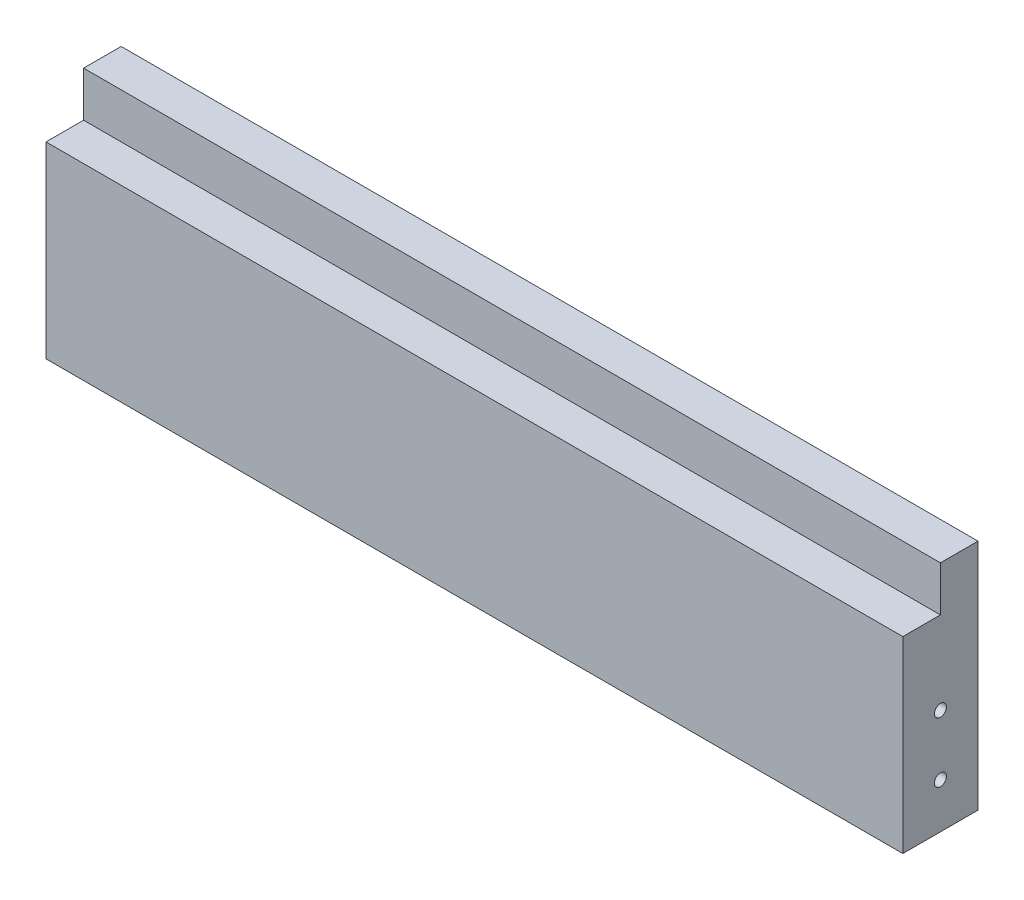
ISO-10303-21;
HEADER;
FILE_DESCRIPTION(('STEP AP214'),'2;1');
FILE_NAME('part.step','',(''),(''),'','','');
FILE_SCHEMA(('AUTOMOTIVE_DESIGN { 1 0 10303 214 1 1 1 1 }'));
ENDSEC;
DATA;
#1=APPLICATION_CONTEXT('core data for automotive mechanical design processes');
#2=APPLICATION_PROTOCOL_DEFINITION('international standard','automotive_design',2000,#1);
#3=PRODUCT_CONTEXT('',#1,'mechanical');
#4=PRODUCT('Part','Part','',(#3));
#5=PRODUCT_RELATED_PRODUCT_CATEGORY('part','',(#4));
#6=PRODUCT_DEFINITION_FORMATION('','',#4);
#7=PRODUCT_DEFINITION_CONTEXT('part definition',#1,'design');
#8=PRODUCT_DEFINITION('design','',#6,#7);
#9=PRODUCT_DEFINITION_SHAPE('','',#8);
#10=(LENGTH_UNIT() NAMED_UNIT(*) SI_UNIT(.MILLI.,.METRE.));
#11=(NAMED_UNIT(*) PLANE_ANGLE_UNIT() SI_UNIT($,.RADIAN.));
#12=(NAMED_UNIT(*) SI_UNIT($,.STERADIAN.) SOLID_ANGLE_UNIT());
#13=UNCERTAINTY_MEASURE_WITH_UNIT(LENGTH_MEASURE(1.E-05),#10,'distance_accuracy_value','');
#14=(GEOMETRIC_REPRESENTATION_CONTEXT(3) GLOBAL_UNCERTAINTY_ASSIGNED_CONTEXT((#13)) GLOBAL_UNIT_ASSIGNED_CONTEXT((#10,
#11,#12)) REPRESENTATION_CONTEXT('',''));
#15=CARTESIAN_POINT('',(0.,0.,0.));
#16=DIRECTION('',(0.,0.,1.));
#17=DIRECTION('',(1.,0.,0.));
#18=AXIS2_PLACEMENT_3D('',#15,#16,#17);
#19=CARTESIAN_POINT('',(0.,0.,10.));
#20=DIRECTION('',(1.,0.,0.));
#21=DIRECTION('',(0.,0.,-1.));
#22=AXIS2_PLACEMENT_3D('',#19,#20,#21);
#23=PLANE('',#22);
#24=CARTESIAN_POINT('',(0.,14.,5.));
#25=DIRECTION('',(-1.,0.,0.));
#26=DIRECTION('',(0.,0.,1.));
#27=AXIS2_PLACEMENT_3D('',#24,#25,#26);
#28=CIRCLE('',#27,0.79999999999999);
#29=CARTESIAN_POINT('',(0.,14.,5.79999999999999));
#30=VERTEX_POINT('',#29);
#31=EDGE_CURVE('E149',#30,#30,#28,.T.);
#32=ORIENTED_EDGE('',*,*,#31,.F.);
#33=EDGE_LOOP('',(#32));
#34=FACE_BOUND('',#33,.T.);
#35=CARTESIAN_POINT('',(0.,6.,5.));
#36=DIRECTION('',(-1.,0.,0.));
#37=DIRECTION('',(0.,0.,1.));
#38=AXIS2_PLACEMENT_3D('',#35,#36,#37);
#39=CIRCLE('',#38,0.79999999999999);
#40=CARTESIAN_POINT('',(0.,6.,5.79999999999999));
#41=VERTEX_POINT('',#40);
#42=EDGE_CURVE('E143',#41,#41,#39,.T.);
#43=ORIENTED_EDGE('',*,*,#42,.F.);
#44=EDGE_LOOP('',(#43));
#45=FACE_BOUND('',#44,.T.);
#46=DIRECTION('',(0.,-1.,0.));
#47=VECTOR('',#46,1.);
#48=CARTESIAN_POINT('',(0.,0.,10.));
#49=LINE('',#48,#47);
#50=CARTESIAN_POINT('',(0.,25.,10.));
#51=VERTEX_POINT('',#50);
#52=CARTESIAN_POINT('',(0.,0.,10.));
#53=VERTEX_POINT('',#52);
#54=EDGE_CURVE('E103',#51,#53,#49,.T.);
#55=ORIENTED_EDGE('',*,*,#54,.F.);
#56=DIRECTION('',(0.,0.,1.));
#57=VECTOR('',#56,1.);
#58=CARTESIAN_POINT('',(0.,25.,5.));
#59=LINE('',#58,#57);
#60=CARTESIAN_POINT('',(0.,25.,5.));
#61=VERTEX_POINT('',#60);
#62=EDGE_CURVE('E53',#61,#51,#59,.T.);
#63=ORIENTED_EDGE('',*,*,#62,.F.);
#64=DIRECTION('',(0.,-1.,0.));
#65=VECTOR('',#64,1.);
#66=CARTESIAN_POINT('',(0.,31.,5.));
#67=LINE('',#66,#65);
#68=CARTESIAN_POINT('',(0.,31.,5.));
#69=VERTEX_POINT('',#68);
#70=EDGE_CURVE('E90',#69,#61,#67,.T.);
#71=ORIENTED_EDGE('',*,*,#70,.F.);
#72=DIRECTION('',(0.,0.,-1.));
#73=VECTOR('',#72,1.);
#74=CARTESIAN_POINT('',(0.,31.,10.));
#75=LINE('',#74,#73);
#76=CARTESIAN_POINT('',(0.,31.,0.));
#77=VERTEX_POINT('',#76);
#78=EDGE_CURVE('E82',#69,#77,#75,.T.);
#79=ORIENTED_EDGE('',*,*,#78,.T.);
#80=DIRECTION('',(0.,-1.,0.));
#81=VECTOR('',#80,1.);
#82=CARTESIAN_POINT('',(0.,0.,0.));
#83=LINE('',#82,#81);
#84=CARTESIAN_POINT('',(0.,0.,0.));
#85=VERTEX_POINT('',#84);
#86=EDGE_CURVE('E87',#77,#85,#83,.T.);
#87=ORIENTED_EDGE('',*,*,#86,.T.);
#88=DIRECTION('',(0.,0.,-1.));
#89=VECTOR('',#88,1.);
#90=CARTESIAN_POINT('',(0.,0.,10.));
#91=LINE('',#90,#89);
#92=EDGE_CURVE('E11',#53,#85,#91,.T.);
#93=ORIENTED_EDGE('',*,*,#92,.F.);
#94=EDGE_LOOP('',(#55,#63,#71,#79,#87,#93));
#95=FACE_BOUND('',#94,.T.);
#96=ADVANCED_FACE('F39',(#34,#45,#95),#23,.F.);
#97=CARTESIAN_POINT('',(0.,0.,10.));
#98=DIRECTION('',(0.,1.,0.));
#99=DIRECTION('',(0.,0.,1.));
#100=AXIS2_PLACEMENT_3D('',#97,#98,#99);
#101=PLANE('',#100);
#102=CARTESIAN_POINT('',(102.,0.,4.99999999999981));
#103=DIRECTION('',(0.,-1.,0.));
#104=DIRECTION('',(0.,0.,-1.));
#105=AXIS2_PLACEMENT_3D('',#102,#103,#104);
#106=CIRCLE('',#105,0.799999999999995);
#107=CARTESIAN_POINT('',(102.,0.,4.19999999999981));
#108=VERTEX_POINT('',#107);
#109=EDGE_CURVE('E191',#108,#108,#106,.T.);
#110=ORIENTED_EDGE('',*,*,#109,.F.);
#111=EDGE_LOOP('',(#110));
#112=FACE_BOUND('',#111,.T.);
#113=CARTESIAN_POINT('',(12.,0.,4.99999999999981));
#114=DIRECTION('',(0.,-1.,0.));
#115=DIRECTION('',(0.,0.,-1.));
#116=AXIS2_PLACEMENT_3D('',#113,#114,#115);
#117=CIRCLE('',#116,0.799999999999999);
#118=CARTESIAN_POINT('',(12.,0.,4.19999999999981));
#119=VERTEX_POINT('',#118);
#120=EDGE_CURVE('E185',#119,#119,#117,.T.);
#121=ORIENTED_EDGE('',*,*,#120,.F.);
#122=EDGE_LOOP('',(#121));
#123=FACE_BOUND('',#122,.T.);
#124=CARTESIAN_POINT('',(57.,0.,4.99999999999981));
#125=DIRECTION('',(0.,-1.,0.));
#126=DIRECTION('',(0.,0.,-1.));
#127=AXIS2_PLACEMENT_3D('',#124,#125,#126);
#128=CIRCLE('',#127,0.800000000000002);
#129=CARTESIAN_POINT('',(57.,0.,4.19999999999981));
#130=VERTEX_POINT('',#129);
#131=EDGE_CURVE('E179',#130,#130,#128,.T.);
#132=ORIENTED_EDGE('',*,*,#131,.F.);
#133=EDGE_LOOP('',(#132));
#134=FACE_BOUND('',#133,.T.);
#135=CARTESIAN_POINT('',(79.,0.,4.99999999999981));
#136=DIRECTION('',(0.,-1.,0.));
#137=DIRECTION('',(0.,0.,-1.));
#138=AXIS2_PLACEMENT_3D('',#135,#136,#137);
#139=CIRCLE('',#138,0.799999999999995);
#140=CARTESIAN_POINT('',(79.,0.,4.19999999999981));
#141=VERTEX_POINT('',#140);
#142=EDGE_CURVE('E173',#141,#141,#139,.T.);
#143=ORIENTED_EDGE('',*,*,#142,.F.);
#144=EDGE_LOOP('',(#143));
#145=FACE_BOUND('',#144,.T.);
#146=CARTESIAN_POINT('',(35.,0.,4.99999999999981));
#147=DIRECTION('',(0.,-1.,0.));
#148=DIRECTION('',(0.,0.,-1.));
#149=AXIS2_PLACEMENT_3D('',#146,#147,#148);
#150=CIRCLE('',#149,0.800000000000002);
#151=CARTESIAN_POINT('',(35.,0.,4.19999999999981));
#152=VERTEX_POINT('',#151);
#153=EDGE_CURVE('E167',#152,#152,#150,.T.);
#154=ORIENTED_EDGE('',*,*,#153,.F.);
#155=EDGE_LOOP('',(#154));
#156=FACE_BOUND('',#155,.T.);
#157=DIRECTION('',(1.,0.,0.));
#158=VECTOR('',#157,1.);
#159=CARTESIAN_POINT('',(0.,0.,0.));
#160=LINE('',#159,#158);
#161=CARTESIAN_POINT('',(114.,0.,0.));
#162=VERTEX_POINT('',#161);
#163=EDGE_CURVE('E107',#85,#162,#160,.T.);
#164=ORIENTED_EDGE('',*,*,#163,.T.);
#165=DIRECTION('',(0.,0.,-1.));
#166=VECTOR('',#165,1.);
#167=CARTESIAN_POINT('',(114.,0.,10.));
#168=LINE('',#167,#166);
#169=CARTESIAN_POINT('',(114.,0.,10.));
#170=VERTEX_POINT('',#169);
#171=EDGE_CURVE('E46',#170,#162,#168,.T.);
#172=ORIENTED_EDGE('',*,*,#171,.F.);
#173=DIRECTION('',(1.,0.,0.));
#174=VECTOR('',#173,1.);
#175=CARTESIAN_POINT('',(0.,0.,10.));
#176=LINE('',#175,#174);
#177=EDGE_CURVE('E62',#53,#170,#176,.T.);
#178=ORIENTED_EDGE('',*,*,#177,.F.);
#179=ORIENTED_EDGE('',*,*,#92,.T.);
#180=EDGE_LOOP('',(#164,#172,#178,#179));
#181=FACE_BOUND('',#180,.T.);
#182=ADVANCED_FACE('F123',(#112,#123,#134,#145,#156,#181),#101,.F.);
#183=CARTESIAN_POINT('',(114.,0.,10.));
#184=DIRECTION('',(-1.,0.,0.));
#185=DIRECTION('',(0.,0.,1.));
#186=AXIS2_PLACEMENT_3D('',#183,#184,#185);
#187=PLANE('',#186);
#188=CARTESIAN_POINT('',(114.,14.,5.));
#189=DIRECTION('',(1.,0.,0.));
#190=DIRECTION('',(0.,0.,-1.));
#191=AXIS2_PLACEMENT_3D('',#188,#189,#190);
#192=CIRCLE('',#191,0.799999999999999);
#193=CARTESIAN_POINT('',(114.,14.,4.2));
#194=VERTEX_POINT('',#193);
#195=EDGE_CURVE('E161',#194,#194,#192,.T.);
#196=ORIENTED_EDGE('',*,*,#195,.F.);
#197=EDGE_LOOP('',(#196));
#198=FACE_BOUND('',#197,.T.);
#199=CARTESIAN_POINT('',(114.,6.,5.));
#200=DIRECTION('',(1.,0.,0.));
#201=DIRECTION('',(0.,0.,-1.));
#202=AXIS2_PLACEMENT_3D('',#199,#200,#201);
#203=CIRCLE('',#202,0.799999999999999);
#204=CARTESIAN_POINT('',(114.,6.,4.2));
#205=VERTEX_POINT('',#204);
#206=EDGE_CURVE('E155',#205,#205,#203,.T.);
#207=ORIENTED_EDGE('',*,*,#206,.F.);
#208=EDGE_LOOP('',(#207));
#209=FACE_BOUND('',#208,.T.);
#210=DIRECTION('',(0.,1.,0.));
#211=VECTOR('',#210,1.);
#212=CARTESIAN_POINT('',(114.,31.,5.));
#213=LINE('',#212,#211);
#214=CARTESIAN_POINT('',(114.,25.,5.));
#215=VERTEX_POINT('',#214);
#216=CARTESIAN_POINT('',(114.,31.,5.));
#217=VERTEX_POINT('',#216);
#218=EDGE_CURVE('E131',#215,#217,#213,.T.);
#219=ORIENTED_EDGE('',*,*,#218,.F.);
#220=DIRECTION('',(0.,0.,1.));
#221=VECTOR('',#220,1.);
#222=CARTESIAN_POINT('',(114.,25.,5.));
#223=LINE('',#222,#221);
#224=CARTESIAN_POINT('',(114.,25.,10.));
#225=VERTEX_POINT('',#224);
#226=EDGE_CURVE('E108',#215,#225,#223,.T.);
#227=ORIENTED_EDGE('',*,*,#226,.T.);
#228=DIRECTION('',(0.,1.,0.));
#229=VECTOR('',#228,1.);
#230=CARTESIAN_POINT('',(114.,0.,10.));
#231=LINE('',#230,#229);
#232=EDGE_CURVE('E94',#170,#225,#231,.T.);
#233=ORIENTED_EDGE('',*,*,#232,.F.);
#234=ORIENTED_EDGE('',*,*,#171,.T.);
#235=DIRECTION('',(0.,1.,0.));
#236=VECTOR('',#235,1.);
#237=CARTESIAN_POINT('',(114.,0.,0.));
#238=LINE('',#237,#236);
#239=CARTESIAN_POINT('',(114.,31.,0.));
#240=VERTEX_POINT('',#239);
#241=EDGE_CURVE('E104',#162,#240,#238,.T.);
#242=ORIENTED_EDGE('',*,*,#241,.T.);
#243=DIRECTION('',(0.,0.,-1.));
#244=VECTOR('',#243,1.);
#245=CARTESIAN_POINT('',(114.,31.,10.));
#246=LINE('',#245,#244);
#247=EDGE_CURVE('E93',#217,#240,#246,.T.);
#248=ORIENTED_EDGE('',*,*,#247,.F.);
#249=EDGE_LOOP('',(#219,#227,#233,#234,#242,#248));
#250=FACE_BOUND('',#249,.T.);
#251=ADVANCED_FACE('F121',(#198,#209,#250),#187,.F.);
#252=CARTESIAN_POINT('',(0.,31.,10.));
#253=DIRECTION('',(0.,-1.,0.));
#254=DIRECTION('',(0.,0.,-1.));
#255=AXIS2_PLACEMENT_3D('',#252,#253,#254);
#256=PLANE('',#255);
#257=ORIENTED_EDGE('',*,*,#78,.F.);
#258=DIRECTION('',(-1.,0.,0.));
#259=VECTOR('',#258,1.);
#260=CARTESIAN_POINT('',(114.,31.,5.));
#261=LINE('',#260,#259);
#262=EDGE_CURVE('E136',#217,#69,#261,.T.);
#263=ORIENTED_EDGE('',*,*,#262,.F.);
#264=ORIENTED_EDGE('',*,*,#247,.T.);
#265=DIRECTION('',(-1.,0.,0.));
#266=VECTOR('',#265,1.);
#267=CARTESIAN_POINT('',(0.,31.,0.));
#268=LINE('',#267,#266);
#269=EDGE_CURVE('E97',#240,#77,#268,.T.);
#270=ORIENTED_EDGE('',*,*,#269,.T.);
#271=EDGE_LOOP('',(#257,#263,#264,#270));
#272=FACE_BOUND('',#271,.T.);
#273=ADVANCED_FACE('F98',(#272),#256,.F.);
#274=CARTESIAN_POINT('',(0.,0.,10.));
#275=DIRECTION('',(0.,0.,-1.));
#276=DIRECTION('',(-1.,0.,0.));
#277=AXIS2_PLACEMENT_3D('',#274,#275,#276);
#278=PLANE('',#277);
#279=ORIENTED_EDGE('',*,*,#232,.T.);
#280=DIRECTION('',(1.,0.,0.));
#281=VECTOR('',#280,1.);
#282=CARTESIAN_POINT('',(114.,25.,10.));
#283=LINE('',#282,#281);
#284=EDGE_CURVE('E129',#51,#225,#283,.T.);
#285=ORIENTED_EDGE('',*,*,#284,.F.);
#286=ORIENTED_EDGE('',*,*,#54,.T.);
#287=ORIENTED_EDGE('',*,*,#177,.T.);
#288=EDGE_LOOP('',(#279,#285,#286,#287));
#289=FACE_BOUND('',#288,.T.);
#290=ADVANCED_FACE('F257',(#289),#278,.F.);
#291=CARTESIAN_POINT('',(0.,0.,0.));
#292=DIRECTION('',(0.,0.,-1.));
#293=DIRECTION('',(-1.,0.,0.));
#294=AXIS2_PLACEMENT_3D('',#291,#292,#293);
#295=PLANE('',#294);
#296=ORIENTED_EDGE('',*,*,#86,.F.);
#297=ORIENTED_EDGE('',*,*,#269,.F.);
#298=ORIENTED_EDGE('',*,*,#241,.F.);
#299=ORIENTED_EDGE('',*,*,#163,.F.);
#300=EDGE_LOOP('',(#296,#297,#298,#299));
#301=FACE_BOUND('',#300,.T.);
#302=ADVANCED_FACE('F106',(#301),#295,.T.);
#303=CARTESIAN_POINT('',(114.,25.,5.));
#304=DIRECTION('',(0.,-1.,0.));
#305=DIRECTION('',(1.,0.,0.));
#306=AXIS2_PLACEMENT_3D('',#303,#304,#305);
#307=PLANE('',#306);
#308=ORIENTED_EDGE('',*,*,#284,.T.);
#309=ORIENTED_EDGE('',*,*,#226,.F.);
#310=DIRECTION('',(1.,0.,0.));
#311=VECTOR('',#310,1.);
#312=CARTESIAN_POINT('',(114.,25.,5.));
#313=LINE('',#312,#311);
#314=EDGE_CURVE('E127',#61,#215,#313,.T.);
#315=ORIENTED_EDGE('',*,*,#314,.F.);
#316=ORIENTED_EDGE('',*,*,#62,.T.);
#317=EDGE_LOOP('',(#308,#309,#315,#316));
#318=FACE_BOUND('',#317,.T.);
#319=ADVANCED_FACE('F253',(#318),#307,.F.);
#320=CARTESIAN_POINT('',(0.,0.,5.));
#321=DIRECTION('',(0.,0.,-1.));
#322=DIRECTION('',(-1.,0.,0.));
#323=AXIS2_PLACEMENT_3D('',#320,#321,#322);
#324=PLANE('',#323);
#325=ORIENTED_EDGE('',*,*,#218,.T.);
#326=ORIENTED_EDGE('',*,*,#262,.T.);
#327=ORIENTED_EDGE('',*,*,#70,.T.);
#328=ORIENTED_EDGE('',*,*,#314,.T.);
#329=EDGE_LOOP('',(#325,#326,#327,#328));
#330=FACE_BOUND('',#329,.T.);
#331=ADVANCED_FACE('F245',(#330),#324,.F.);
#332=CARTESIAN_POINT('',(7.,6.,5.));
#333=DIRECTION('',(-1.,0.,0.));
#334=DIRECTION('',(0.,0.,1.));
#335=AXIS2_PLACEMENT_3D('',#332,#333,#334);
#336=CONICAL_SURFACE('',#335,0.799999999999998,1.02974425867665);
#337=CARTESIAN_POINT('',(7.48068849522205,6.,5.));
#338=VERTEX_POINT('',#337);
#339=VERTEX_LOOP('',#338);
#340=FACE_BOUND('',#339,.T.);
#341=CARTESIAN_POINT('',(7.,6.,5.));
#342=DIRECTION('',(-1.,0.,0.));
#343=DIRECTION('',(0.,0.,1.));
#344=AXIS2_PLACEMENT_3D('',#341,#342,#343);
#345=CIRCLE('',#344,0.799999999999998);
#346=CARTESIAN_POINT('',(7.,6.,5.8));
#347=VERTEX_POINT('',#346);
#348=EDGE_CURVE('E132',#347,#347,#345,.T.);
#349=ORIENTED_EDGE('',*,*,#348,.T.);
#350=EDGE_LOOP('',(#349));
#351=FACE_BOUND('',#350,.T.);
#352=ADVANCED_FACE('F235',(#340,#351),#336,.F.);
#353=CARTESIAN_POINT('',(0.,6.,5.));
#354=DIRECTION('',(-1.,0.,0.));
#355=DIRECTION('',(0.,0.,1.));
#356=AXIS2_PLACEMENT_3D('',#353,#354,#355);
#357=CYLINDRICAL_SURFACE('',#356,0.799999999999994);
#358=ORIENTED_EDGE('',*,*,#348,.F.);
#359=EDGE_LOOP('',(#358));
#360=FACE_BOUND('',#359,.T.);
#361=ORIENTED_EDGE('',*,*,#42,.T.);
#362=EDGE_LOOP('',(#361));
#363=FACE_BOUND('',#362,.T.);
#364=ADVANCED_FACE('F232',(#360,#363),#357,.F.);
#365=CARTESIAN_POINT('',(7.,14.,5.));
#366=DIRECTION('',(-1.,0.,0.));
#367=DIRECTION('',(0.,0.,1.));
#368=AXIS2_PLACEMENT_3D('',#365,#366,#367);
#369=CONICAL_SURFACE('',#368,0.799999999999999,1.02974425867665);
#370=CARTESIAN_POINT('',(7.48068849522205,14.,5.));
#371=VERTEX_POINT('',#370);
#372=VERTEX_LOOP('',#371);
#373=FACE_BOUND('',#372,.T.);
#374=CARTESIAN_POINT('',(7.,14.,5.));
#375=DIRECTION('',(-1.,0.,0.));
#376=DIRECTION('',(0.,0.,1.));
#377=AXIS2_PLACEMENT_3D('',#374,#375,#376);
#378=CIRCLE('',#377,0.799999999999999);
#379=CARTESIAN_POINT('',(7.,14.,5.8));
#380=VERTEX_POINT('',#379);
#381=EDGE_CURVE('E146',#380,#380,#378,.T.);
#382=ORIENTED_EDGE('',*,*,#381,.T.);
#383=EDGE_LOOP('',(#382));
#384=FACE_BOUND('',#383,.T.);
#385=ADVANCED_FACE('F234',(#373,#384),#369,.F.);
#386=CARTESIAN_POINT('',(0.,14.,5.));
#387=DIRECTION('',(-1.,0.,0.));
#388=DIRECTION('',(0.,0.,1.));
#389=AXIS2_PLACEMENT_3D('',#386,#387,#388);
#390=CYLINDRICAL_SURFACE('',#389,0.799999999999994);
#391=ORIENTED_EDGE('',*,*,#381,.F.);
#392=EDGE_LOOP('',(#391));
#393=FACE_BOUND('',#392,.T.);
#394=ORIENTED_EDGE('',*,*,#31,.T.);
#395=EDGE_LOOP('',(#394));
#396=FACE_BOUND('',#395,.T.);
#397=ADVANCED_FACE('F242',(#393,#396),#390,.F.);
#398=CARTESIAN_POINT('',(107.,6.,5.));
#399=DIRECTION('',(1.,0.,0.));
#400=DIRECTION('',(0.,0.,-1.));
#401=AXIS2_PLACEMENT_3D('',#398,#399,#400);
#402=CONICAL_SURFACE('',#401,0.799999999999999,1.02974425867666);
#403=CARTESIAN_POINT('',(106.519311504778,6.,5.));
#404=VERTEX_POINT('',#403);
#405=VERTEX_LOOP('',#404);
#406=FACE_BOUND('',#405,.T.);
#407=CARTESIAN_POINT('',(107.,6.,5.));
#408=DIRECTION('',(1.,0.,0.));
#409=DIRECTION('',(0.,0.,-1.));
#410=AXIS2_PLACEMENT_3D('',#407,#408,#409);
#411=CIRCLE('',#410,0.799999999999999);
#412=CARTESIAN_POINT('',(107.,6.,4.2));
#413=VERTEX_POINT('',#412);
#414=EDGE_CURVE('E152',#413,#413,#411,.T.);
#415=ORIENTED_EDGE('',*,*,#414,.T.);
#416=EDGE_LOOP('',(#415));
#417=FACE_BOUND('',#416,.T.);
#418=ADVANCED_FACE('F275',(#406,#417),#402,.F.);
#419=CARTESIAN_POINT('',(114.,6.,5.));
#420=DIRECTION('',(1.,0.,0.));
#421=DIRECTION('',(0.,0.,-1.));
#422=AXIS2_PLACEMENT_3D('',#419,#420,#421);
#423=CYLINDRICAL_SURFACE('',#422,0.799999999999999);
#424=ORIENTED_EDGE('',*,*,#414,.F.);
#425=EDGE_LOOP('',(#424));
#426=FACE_BOUND('',#425,.T.);
#427=ORIENTED_EDGE('',*,*,#206,.T.);
#428=EDGE_LOOP('',(#427));
#429=FACE_BOUND('',#428,.T.);
#430=ADVANCED_FACE('F272',(#426,#429),#423,.F.);
#431=CARTESIAN_POINT('',(107.,14.,5.));
#432=DIRECTION('',(1.,0.,0.));
#433=DIRECTION('',(0.,0.,-1.));
#434=AXIS2_PLACEMENT_3D('',#431,#432,#433);
#435=CONICAL_SURFACE('',#434,0.799999999999999,1.02974425867666);
#436=CARTESIAN_POINT('',(106.519311504778,14.,5.));
#437=VERTEX_POINT('',#436);
#438=VERTEX_LOOP('',#437);
#439=FACE_BOUND('',#438,.T.);
#440=CARTESIAN_POINT('',(107.,14.,5.));
#441=DIRECTION('',(1.,0.,0.));
#442=DIRECTION('',(0.,0.,-1.));
#443=AXIS2_PLACEMENT_3D('',#440,#441,#442);
#444=CIRCLE('',#443,0.799999999999999);
#445=CARTESIAN_POINT('',(107.,14.,4.2));
#446=VERTEX_POINT('',#445);
#447=EDGE_CURVE('E158',#446,#446,#444,.T.);
#448=ORIENTED_EDGE('',*,*,#447,.T.);
#449=EDGE_LOOP('',(#448));
#450=FACE_BOUND('',#449,.T.);
#451=ADVANCED_FACE('F274',(#439,#450),#435,.F.);
#452=CARTESIAN_POINT('',(114.,14.,5.));
#453=DIRECTION('',(1.,0.,0.));
#454=DIRECTION('',(0.,0.,-1.));
#455=AXIS2_PLACEMENT_3D('',#452,#453,#454);
#456=CYLINDRICAL_SURFACE('',#455,0.799999999999999);
#457=ORIENTED_EDGE('',*,*,#447,.F.);
#458=EDGE_LOOP('',(#457));
#459=FACE_BOUND('',#458,.T.);
#460=ORIENTED_EDGE('',*,*,#195,.T.);
#461=EDGE_LOOP('',(#460));
#462=FACE_BOUND('',#461,.T.);
#463=ADVANCED_FACE('F220',(#459,#462),#456,.F.);
#464=CARTESIAN_POINT('',(35.,7.,4.99999999999981));
#465=DIRECTION('',(0.,-1.,0.));
#466=DIRECTION('',(0.,0.,-1.));
#467=AXIS2_PLACEMENT_3D('',#464,#465,#466);
#468=CONICAL_SURFACE('',#467,0.799999999999995,1.02974425867665);
#469=CARTESIAN_POINT('',(35.,7.48068849522205,4.99999999999981));
#470=VERTEX_POINT('',#469);
#471=VERTEX_LOOP('',#470);
#472=FACE_BOUND('',#471,.T.);
#473=CARTESIAN_POINT('',(35.,7.,4.99999999999981));
#474=DIRECTION('',(0.,-1.,0.));
#475=DIRECTION('',(0.,0.,-1.));
#476=AXIS2_PLACEMENT_3D('',#473,#474,#475);
#477=CIRCLE('',#476,0.799999999999995);
#478=CARTESIAN_POINT('',(35.,7.,4.19999999999981));
#479=VERTEX_POINT('',#478);
#480=EDGE_CURVE('E164',#479,#479,#477,.T.);
#481=ORIENTED_EDGE('',*,*,#480,.T.);
#482=EDGE_LOOP('',(#481));
#483=FACE_BOUND('',#482,.T.);
#484=ADVANCED_FACE('F210',(#472,#483),#468,.F.);
#485=CARTESIAN_POINT('',(35.,0.,4.99999999999981));
#486=DIRECTION('',(0.,-1.,0.));
#487=DIRECTION('',(0.,0.,-1.));
#488=AXIS2_PLACEMENT_3D('',#485,#486,#487);
#489=CYLINDRICAL_SURFACE('',#488,0.799999999999999);
#490=ORIENTED_EDGE('',*,*,#480,.F.);
#491=EDGE_LOOP('',(#490));
#492=FACE_BOUND('',#491,.T.);
#493=ORIENTED_EDGE('',*,*,#153,.T.);
#494=EDGE_LOOP('',(#493));
#495=FACE_BOUND('',#494,.T.);
#496=ADVANCED_FACE('F207',(#492,#495),#489,.F.);
#497=CARTESIAN_POINT('',(79.,7.,4.99999999999981));
#498=DIRECTION('',(0.,-1.,0.));
#499=DIRECTION('',(0.,0.,-1.));
#500=AXIS2_PLACEMENT_3D('',#497,#498,#499);
#501=CONICAL_SURFACE('',#500,0.799999999999995,1.02974425867665);
#502=CARTESIAN_POINT('',(79.,7.48068849522205,4.99999999999981));
#503=VERTEX_POINT('',#502);
#504=VERTEX_LOOP('',#503);
#505=FACE_BOUND('',#504,.T.);
#506=CARTESIAN_POINT('',(79.,7.,4.99999999999981));
#507=DIRECTION('',(0.,-1.,0.));
#508=DIRECTION('',(0.,0.,-1.));
#509=AXIS2_PLACEMENT_3D('',#506,#507,#508);
#510=CIRCLE('',#509,0.799999999999995);
#511=CARTESIAN_POINT('',(79.,7.,4.19999999999981));
#512=VERTEX_POINT('',#511);
#513=EDGE_CURVE('E170',#512,#512,#510,.T.);
#514=ORIENTED_EDGE('',*,*,#513,.T.);
#515=EDGE_LOOP('',(#514));
#516=FACE_BOUND('',#515,.T.);
#517=ADVANCED_FACE('F209',(#505,#516),#501,.F.);
#518=CARTESIAN_POINT('',(79.,0.,4.99999999999981));
#519=DIRECTION('',(0.,-1.,0.));
#520=DIRECTION('',(0.,0.,-1.));
#521=AXIS2_PLACEMENT_3D('',#518,#519,#520);
#522=CYLINDRICAL_SURFACE('',#521,0.799999999999995);
#523=ORIENTED_EDGE('',*,*,#513,.F.);
#524=EDGE_LOOP('',(#523));
#525=FACE_BOUND('',#524,.T.);
#526=ORIENTED_EDGE('',*,*,#142,.T.);
#527=EDGE_LOOP('',(#526));
#528=FACE_BOUND('',#527,.T.);
#529=ADVANCED_FACE('F217',(#525,#528),#522,.F.);
#530=CARTESIAN_POINT('',(57.,7.,4.99999999999981));
#531=DIRECTION('',(0.,-1.,0.));
#532=DIRECTION('',(0.,0.,-1.));
#533=AXIS2_PLACEMENT_3D('',#530,#531,#532);
#534=CONICAL_SURFACE('',#533,0.799999999999995,1.02974425867665);
#535=CARTESIAN_POINT('',(57.,7.48068849522205,4.99999999999981));
#536=VERTEX_POINT('',#535);
#537=VERTEX_LOOP('',#536);
#538=FACE_BOUND('',#537,.T.);
#539=CARTESIAN_POINT('',(57.,7.,4.99999999999981));
#540=DIRECTION('',(0.,-1.,0.));
#541=DIRECTION('',(0.,0.,-1.));
#542=AXIS2_PLACEMENT_3D('',#539,#540,#541);
#543=CIRCLE('',#542,0.799999999999995);
#544=CARTESIAN_POINT('',(57.,7.,4.19999999999981));
#545=VERTEX_POINT('',#544);
#546=EDGE_CURVE('E176',#545,#545,#543,.T.);
#547=ORIENTED_EDGE('',*,*,#546,.T.);
#548=EDGE_LOOP('',(#547));
#549=FACE_BOUND('',#548,.T.);
#550=ADVANCED_FACE('F365',(#538,#549),#534,.F.);
#551=CARTESIAN_POINT('',(57.,0.,4.99999999999981));
#552=DIRECTION('',(0.,-1.,0.));
#553=DIRECTION('',(0.,0.,-1.));
#554=AXIS2_PLACEMENT_3D('',#551,#552,#553);
#555=CYLINDRICAL_SURFACE('',#554,0.799999999999999);
#556=ORIENTED_EDGE('',*,*,#546,.F.);
#557=EDGE_LOOP('',(#556));
#558=FACE_BOUND('',#557,.T.);
#559=ORIENTED_EDGE('',*,*,#131,.T.);
#560=EDGE_LOOP('',(#559));
#561=FACE_BOUND('',#560,.T.);
#562=ADVANCED_FACE('F377',(#558,#561),#555,.F.);
#563=CARTESIAN_POINT('',(12.,7.,4.99999999999981));
#564=DIRECTION('',(0.,-1.,0.));
#565=DIRECTION('',(0.,0.,-1.));
#566=AXIS2_PLACEMENT_3D('',#563,#564,#565);
#567=CONICAL_SURFACE('',#566,0.799999999999999,1.02974425867665);
#568=CARTESIAN_POINT('',(12.,7.48068849522205,4.99999999999981));
#569=VERTEX_POINT('',#568);
#570=VERTEX_LOOP('',#569);
#571=FACE_BOUND('',#570,.T.);
#572=CARTESIAN_POINT('',(12.,7.,4.99999999999981));
#573=DIRECTION('',(0.,-1.,0.));
#574=DIRECTION('',(0.,0.,-1.));
#575=AXIS2_PLACEMENT_3D('',#572,#573,#574);
#576=CIRCLE('',#575,0.799999999999999);
#577=CARTESIAN_POINT('',(12.,7.,4.19999999999981));
#578=VERTEX_POINT('',#577);
#579=EDGE_CURVE('E182',#578,#578,#576,.T.);
#580=ORIENTED_EDGE('',*,*,#579,.T.);
#581=EDGE_LOOP('',(#580));
#582=FACE_BOUND('',#581,.T.);
#583=ADVANCED_FACE('F387',(#571,#582),#567,.F.);
#584=CARTESIAN_POINT('',(12.,0.,4.99999999999981));
#585=DIRECTION('',(0.,-1.,0.));
#586=DIRECTION('',(0.,0.,-1.));
#587=AXIS2_PLACEMENT_3D('',#584,#585,#586);
#588=CYLINDRICAL_SURFACE('',#587,0.799999999999999);
#589=ORIENTED_EDGE('',*,*,#579,.F.);
#590=EDGE_LOOP('',(#589));
#591=FACE_BOUND('',#590,.T.);
#592=ORIENTED_EDGE('',*,*,#120,.T.);
#593=EDGE_LOOP('',(#592));
#594=FACE_BOUND('',#593,.T.);
#595=ADVANCED_FACE('F398',(#591,#594),#588,.F.);
#596=CARTESIAN_POINT('',(102.,7.,4.99999999999981));
#597=DIRECTION('',(0.,-1.,0.));
#598=DIRECTION('',(0.,0.,-1.));
#599=AXIS2_PLACEMENT_3D('',#596,#597,#598);
#600=CONICAL_SURFACE('',#599,0.799999999999995,1.02974425867665);
#601=CARTESIAN_POINT('',(102.,7.48068849522205,4.99999999999981));
#602=VERTEX_POINT('',#601);
#603=VERTEX_LOOP('',#602);
#604=FACE_BOUND('',#603,.T.);
#605=CARTESIAN_POINT('',(102.,7.,4.99999999999981));
#606=DIRECTION('',(0.,-1.,0.));
#607=DIRECTION('',(0.,0.,-1.));
#608=AXIS2_PLACEMENT_3D('',#605,#606,#607);
#609=CIRCLE('',#608,0.799999999999995);
#610=CARTESIAN_POINT('',(102.,7.,4.19999999999981));
#611=VERTEX_POINT('',#610);
#612=EDGE_CURVE('E188',#611,#611,#609,.T.);
#613=ORIENTED_EDGE('',*,*,#612,.T.);
#614=EDGE_LOOP('',(#613));
#615=FACE_BOUND('',#614,.T.);
#616=ADVANCED_FACE('F408',(#604,#615),#600,.F.);
#617=CARTESIAN_POINT('',(102.,0.,4.99999999999981));
#618=DIRECTION('',(0.,-1.,0.));
#619=DIRECTION('',(0.,0.,-1.));
#620=AXIS2_PLACEMENT_3D('',#617,#618,#619);
#621=CYLINDRICAL_SURFACE('',#620,0.799999999999995);
#622=ORIENTED_EDGE('',*,*,#612,.F.);
#623=EDGE_LOOP('',(#622));
#624=FACE_BOUND('',#623,.T.);
#625=ORIENTED_EDGE('',*,*,#109,.T.);
#626=EDGE_LOOP('',(#625));
#627=FACE_BOUND('',#626,.T.);
#628=ADVANCED_FACE('F195',(#624,#627),#621,.F.);
#629=CLOSED_SHELL('',(#96,#182,#251,#273,#290,#302,#319,#331,#352,#364,#385,#397,#418,#430,#451,
#463,#484,#496,#517,#529,#550,#562,#583,#595,#616,#628));
#630=MANIFOLD_SOLID_BREP('B2',#629);
#631=ADVANCED_BREP_SHAPE_REPRESENTATION('',(#18,#630),#14);
#632=SHAPE_DEFINITION_REPRESENTATION(#9,#631);
ENDSEC;
END-ISO-10303-21;
